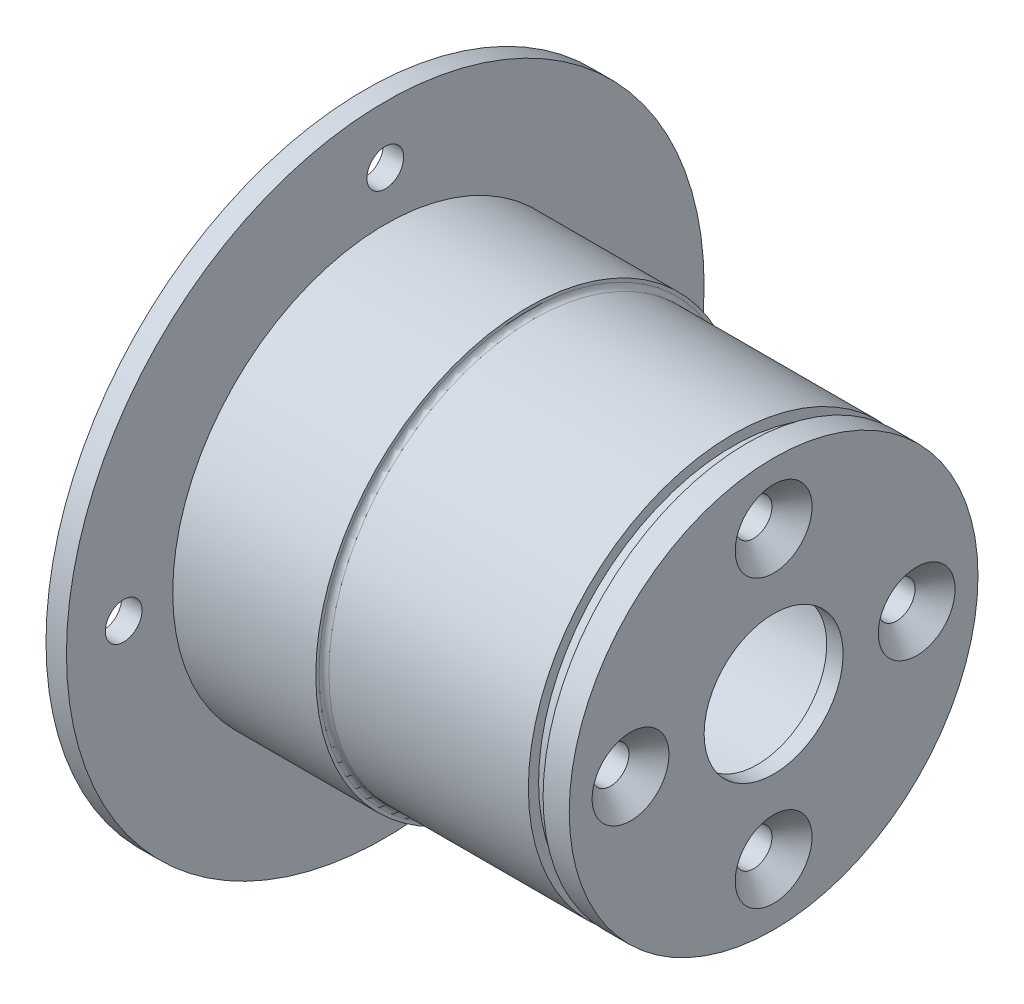
ISO-10303-21;
HEADER;
FILE_DESCRIPTION(('STEP AP214'),'2;1');
FILE_NAME('part.step','',(''),(''),'','','');
FILE_SCHEMA(('AUTOMOTIVE_DESIGN { 1 0 10303 214 1 1 1 1 }'));
ENDSEC;
DATA;
#1=APPLICATION_CONTEXT('core data for automotive mechanical design processes');
#2=APPLICATION_PROTOCOL_DEFINITION('international standard','automotive_design',2000,#1);
#3=PRODUCT_CONTEXT('',#1,'mechanical');
#4=PRODUCT('Part','Part','',(#3));
#5=PRODUCT_RELATED_PRODUCT_CATEGORY('part','',(#4));
#6=PRODUCT_DEFINITION_FORMATION('','',#4);
#7=PRODUCT_DEFINITION_CONTEXT('part definition',#1,'design');
#8=PRODUCT_DEFINITION('design','',#6,#7);
#9=PRODUCT_DEFINITION_SHAPE('','',#8);
#10=(LENGTH_UNIT() NAMED_UNIT(*) SI_UNIT(.MILLI.,.METRE.));
#11=(NAMED_UNIT(*) PLANE_ANGLE_UNIT() SI_UNIT($,.RADIAN.));
#12=(NAMED_UNIT(*) SI_UNIT($,.STERADIAN.) SOLID_ANGLE_UNIT());
#13=UNCERTAINTY_MEASURE_WITH_UNIT(LENGTH_MEASURE(1.E-05),#10,'distance_accuracy_value','');
#14=(GEOMETRIC_REPRESENTATION_CONTEXT(3) GLOBAL_UNCERTAINTY_ASSIGNED_CONTEXT((#13)) GLOBAL_UNIT_ASSIGNED_CONTEXT((#10,
#11,#12)) REPRESENTATION_CONTEXT('',''));
#15=CARTESIAN_POINT('',(0.,0.,0.));
#16=DIRECTION('',(0.,0.,1.));
#17=DIRECTION('',(1.,0.,0.));
#18=AXIS2_PLACEMENT_3D('',#15,#16,#17);
#19=CARTESIAN_POINT('',(0.,39.,0.));
#20=DIRECTION('',(1.,0.,0.));
#21=DIRECTION('',(0.,0.,-1.));
#22=AXIS2_PLACEMENT_3D('',#19,#20,#21);
#23=PLANE('',#22);
#24=CARTESIAN_POINT('',(0.,-32.,0.));
#25=DIRECTION('',(-1.,0.,0.));
#26=DIRECTION('',(0.,0.,1.));
#27=AXIS2_PLACEMENT_3D('',#24,#25,#26);
#28=CIRCLE('',#27,2.25);
#29=CARTESIAN_POINT('',(0.,-32.,2.25));
#30=VERTEX_POINT('',#29);
#31=EDGE_CURVE('E144',#30,#30,#28,.T.);
#32=ORIENTED_EDGE('',*,*,#31,.F.);
#33=EDGE_LOOP('',(#32));
#34=FACE_BOUND('',#33,.T.);
#35=CARTESIAN_POINT('',(0.,0.,32.));
#36=DIRECTION('',(-1.,0.,0.));
#37=DIRECTION('',(0.,0.,1.));
#38=AXIS2_PLACEMENT_3D('',#35,#36,#37);
#39=CIRCLE('',#38,2.25);
#40=CARTESIAN_POINT('',(0.,0.,34.25));
#41=VERTEX_POINT('',#40);
#42=EDGE_CURVE('E138',#41,#41,#39,.T.);
#43=ORIENTED_EDGE('',*,*,#42,.F.);
#44=EDGE_LOOP('',(#43));
#45=FACE_BOUND('',#44,.T.);
#46=CARTESIAN_POINT('',(0.,0.,-32.));
#47=DIRECTION('',(-1.,0.,0.));
#48=DIRECTION('',(0.,0.,1.));
#49=AXIS2_PLACEMENT_3D('',#46,#47,#48);
#50=CIRCLE('',#49,2.25);
#51=CARTESIAN_POINT('',(0.,0.,-29.75));
#52=VERTEX_POINT('',#51);
#53=EDGE_CURVE('E132',#52,#52,#50,.T.);
#54=ORIENTED_EDGE('',*,*,#53,.F.);
#55=EDGE_LOOP('',(#54));
#56=FACE_BOUND('',#55,.T.);
#57=CARTESIAN_POINT('',(0.,0.,0.));
#58=DIRECTION('',(-1.,0.,0.));
#59=DIRECTION('',(0.,0.,1.));
#60=AXIS2_PLACEMENT_3D('',#57,#58,#59);
#61=CIRCLE('',#60,21.);
#62=CARTESIAN_POINT('',(0.,0.,21.));
#63=VERTEX_POINT('',#62);
#64=EDGE_CURVE('E45',#63,#63,#61,.T.);
#65=ORIENTED_EDGE('',*,*,#64,.F.);
#66=EDGE_LOOP('',(#65));
#67=FACE_BOUND('',#66,.T.);
#68=CARTESIAN_POINT('',(0.,0.,0.));
#69=DIRECTION('',(-1.,0.,0.));
#70=DIRECTION('',(0.,0.,1.));
#71=AXIS2_PLACEMENT_3D('',#68,#69,#70);
#72=CIRCLE('',#71,39.);
#73=CARTESIAN_POINT('',(0.,0.,39.));
#74=VERTEX_POINT('',#73);
#75=EDGE_CURVE('E78',#74,#74,#72,.T.);
#76=ORIENTED_EDGE('',*,*,#75,.T.);
#77=EDGE_LOOP('',(#76));
#78=FACE_BOUND('',#77,.T.);
#79=CARTESIAN_POINT('',(0.,32.,0.));
#80=DIRECTION('',(-1.,0.,0.));
#81=DIRECTION('',(0.,0.,1.));
#82=AXIS2_PLACEMENT_3D('',#79,#80,#81);
#83=CIRCLE('',#82,2.25);
#84=CARTESIAN_POINT('',(0.,32.,2.25));
#85=VERTEX_POINT('',#84);
#86=EDGE_CURVE('E150',#85,#85,#83,.T.);
#87=ORIENTED_EDGE('',*,*,#86,.F.);
#88=EDGE_LOOP('',(#87));
#89=FACE_BOUND('',#88,.T.);
#90=ADVANCED_FACE('F34',(#34,#45,#56,#67,#78,#89),#23,.F.);
#91=CARTESIAN_POINT('',(-64.1033524540557,0.,0.));
#92=DIRECTION('',(-1.,0.,0.));
#93=DIRECTION('',(0.,0.,1.));
#94=AXIS2_PLACEMENT_3D('',#91,#92,#93);
#95=CYLINDRICAL_SURFACE('',#94,25.);
#96=CARTESIAN_POINT('',(20.6,0.,0.));
#97=DIRECTION('',(-1.,0.,0.));
#98=DIRECTION('',(0.,0.,1.));
#99=AXIS2_PLACEMENT_3D('',#96,#97,#98);
#100=CIRCLE('',#99,25.);
#101=CARTESIAN_POINT('',(20.6,0.,25.));
#102=VERTEX_POINT('',#101);
#103=EDGE_CURVE('E10',#102,#102,#100,.F.);
#104=ORIENTED_EDGE('',*,*,#103,.T.);
#105=EDGE_LOOP('',(#104));
#106=FACE_BOUND('',#105,.T.);
#107=CARTESIAN_POINT('',(45.,0.,0.));
#108=DIRECTION('',(1.,0.,0.));
#109=DIRECTION('',(0.,0.,-1.));
#110=AXIS2_PLACEMENT_3D('',#107,#108,#109);
#111=CIRCLE('',#110,25.);
#112=CARTESIAN_POINT('',(45.,0.,-25.));
#113=VERTEX_POINT('',#112);
#114=EDGE_CURVE('E118',#113,#113,#111,.T.);
#115=ORIENTED_EDGE('',*,*,#114,.F.);
#116=EDGE_LOOP('',(#115));
#117=FACE_BOUND('',#116,.T.);
#118=ADVANCED_FACE('F157',(#106,#117),#95,.T.);
#119=CARTESIAN_POINT('',(50.,8.5,0.));
#120=DIRECTION('',(-1.,0.,0.));
#121=DIRECTION('',(0.,0.,1.));
#122=AXIS2_PLACEMENT_3D('',#119,#120,#121);
#123=PLANE('',#122);
#124=CARTESIAN_POINT('',(50.,17.5,0.));
#125=DIRECTION('',(1.,0.,0.));
#126=DIRECTION('',(0.,0.,-1.));
#127=AXIS2_PLACEMENT_3D('',#124,#125,#126);
#128=CIRCLE('',#127,4.7);
#129=CARTESIAN_POINT('',(50.,17.5,-4.7));
#130=VERTEX_POINT('',#129);
#131=EDGE_CURVE('E114',#130,#130,#128,.T.);
#132=ORIENTED_EDGE('',*,*,#131,.F.);
#133=EDGE_LOOP('',(#132));
#134=FACE_BOUND('',#133,.T.);
#135=CARTESIAN_POINT('',(50.,-17.5,0.));
#136=DIRECTION('',(1.,0.,0.));
#137=DIRECTION('',(0.,0.,-1.));
#138=AXIS2_PLACEMENT_3D('',#135,#136,#137);
#139=CIRCLE('',#138,4.7);
#140=CARTESIAN_POINT('',(50.,-17.5,-4.7));
#141=VERTEX_POINT('',#140);
#142=EDGE_CURVE('E96',#141,#141,#139,.T.);
#143=ORIENTED_EDGE('',*,*,#142,.F.);
#144=EDGE_LOOP('',(#143));
#145=FACE_BOUND('',#144,.T.);
#146=CARTESIAN_POINT('',(50.,0.,17.5));
#147=DIRECTION('',(1.,0.,0.));
#148=DIRECTION('',(0.,0.,-1.));
#149=AXIS2_PLACEMENT_3D('',#146,#147,#148);
#150=CIRCLE('',#149,4.7);
#151=CARTESIAN_POINT('',(50.,0.,12.8));
#152=VERTEX_POINT('',#151);
#153=EDGE_CURVE('E87',#152,#152,#150,.T.);
#154=ORIENTED_EDGE('',*,*,#153,.F.);
#155=EDGE_LOOP('',(#154));
#156=FACE_BOUND('',#155,.T.);
#157=CARTESIAN_POINT('',(50.,0.,0.));
#158=DIRECTION('',(-1.,0.,0.));
#159=DIRECTION('',(0.,0.,1.));
#160=AXIS2_PLACEMENT_3D('',#157,#158,#159);
#161=CIRCLE('',#160,25.);
#162=CARTESIAN_POINT('',(50.,0.,25.));
#163=VERTEX_POINT('',#162);
#164=EDGE_CURVE('E66',#163,#163,#161,.T.);
#165=ORIENTED_EDGE('',*,*,#164,.F.);
#166=EDGE_LOOP('',(#165));
#167=FACE_BOUND('',#166,.T.);
#168=CARTESIAN_POINT('',(50.,0.,0.));
#169=DIRECTION('',(-1.,0.,0.));
#170=DIRECTION('',(0.,0.,1.));
#171=AXIS2_PLACEMENT_3D('',#168,#169,#170);
#172=CIRCLE('',#171,8.5);
#173=CARTESIAN_POINT('',(50.,0.,8.5));
#174=VERTEX_POINT('',#173);
#175=EDGE_CURVE('E63',#174,#174,#172,.T.);
#176=ORIENTED_EDGE('',*,*,#175,.T.);
#177=EDGE_LOOP('',(#176));
#178=FACE_BOUND('',#177,.T.);
#179=CARTESIAN_POINT('',(50.,0.,-17.5));
#180=DIRECTION('',(1.,0.,0.));
#181=DIRECTION('',(0.,0.,-1.));
#182=AXIS2_PLACEMENT_3D('',#179,#180,#181);
#183=CIRCLE('',#182,4.7);
#184=CARTESIAN_POINT('',(50.,0.,-22.2));
#185=VERTEX_POINT('',#184);
#186=EDGE_CURVE('E105',#185,#185,#183,.T.);
#187=ORIENTED_EDGE('',*,*,#186,.F.);
#188=EDGE_LOOP('',(#187));
#189=FACE_BOUND('',#188,.T.);
#190=ADVANCED_FACE('F163',(#134,#145,#156,#167,#178,#189),#123,.F.);
#191=CARTESIAN_POINT('',(-64.1033524540557,0.,0.));
#192=DIRECTION('',(-1.,0.,0.));
#193=DIRECTION('',(0.,0.,1.));
#194=AXIS2_PLACEMENT_3D('',#191,#192,#193);
#195=CYLINDRICAL_SURFACE('',#194,21.);
#196=CARTESIAN_POINT('',(35.,0.,0.));
#197=DIRECTION('',(-1.,0.,0.));
#198=DIRECTION('',(0.,0.,1.));
#199=AXIS2_PLACEMENT_3D('',#196,#197,#198);
#200=CIRCLE('',#199,21.);
#201=CARTESIAN_POINT('',(35.,0.,21.));
#202=VERTEX_POINT('',#201);
#203=EDGE_CURVE('E49',#202,#202,#200,.T.);
#204=ORIENTED_EDGE('',*,*,#203,.F.);
#205=EDGE_LOOP('',(#204));
#206=FACE_BOUND('',#205,.T.);
#207=ORIENTED_EDGE('',*,*,#64,.T.);
#208=EDGE_LOOP('',(#207));
#209=FACE_BOUND('',#208,.T.);
#210=ADVANCED_FACE('F192',(#206,#209),#195,.F.);
#211=CARTESIAN_POINT('',(35.,21.,0.));
#212=DIRECTION('',(1.,0.,0.));
#213=DIRECTION('',(0.,0.,-1.));
#214=AXIS2_PLACEMENT_3D('',#211,#212,#213);
#215=PLANE('',#214);
#216=CARTESIAN_POINT('',(35.,17.5,0.));
#217=DIRECTION('',(1.,0.,0.));
#218=DIRECTION('',(0.,0.,-1.));
#219=AXIS2_PLACEMENT_3D('',#216,#217,#218);
#220=CIRCLE('',#219,2.24999999999999);
#221=CARTESIAN_POINT('',(35.,17.5,-2.24999999999999));
#222=VERTEX_POINT('',#221);
#223=EDGE_CURVE('E108',#222,#222,#220,.T.);
#224=ORIENTED_EDGE('',*,*,#223,.T.);
#225=EDGE_LOOP('',(#224));
#226=FACE_BOUND('',#225,.T.);
#227=CARTESIAN_POINT('',(35.,0.,-17.5));
#228=DIRECTION('',(1.,0.,0.));
#229=DIRECTION('',(0.,0.,-1.));
#230=AXIS2_PLACEMENT_3D('',#227,#228,#229);
#231=CIRCLE('',#230,2.24999999999999);
#232=CARTESIAN_POINT('',(35.,0.,-19.75));
#233=VERTEX_POINT('',#232);
#234=EDGE_CURVE('E99',#233,#233,#231,.T.);
#235=ORIENTED_EDGE('',*,*,#234,.T.);
#236=EDGE_LOOP('',(#235));
#237=FACE_BOUND('',#236,.T.);
#238=CARTESIAN_POINT('',(35.,-17.5,0.));
#239=DIRECTION('',(1.,0.,0.));
#240=DIRECTION('',(0.,0.,-1.));
#241=AXIS2_PLACEMENT_3D('',#238,#239,#240);
#242=CIRCLE('',#241,2.24999999999999);
#243=CARTESIAN_POINT('',(35.,-17.5,-2.24999999999999));
#244=VERTEX_POINT('',#243);
#245=EDGE_CURVE('E90',#244,#244,#242,.T.);
#246=ORIENTED_EDGE('',*,*,#245,.T.);
#247=EDGE_LOOP('',(#246));
#248=FACE_BOUND('',#247,.T.);
#249=CARTESIAN_POINT('',(35.,0.,17.5));
#250=DIRECTION('',(1.,0.,0.));
#251=DIRECTION('',(0.,0.,-1.));
#252=AXIS2_PLACEMENT_3D('',#249,#250,#251);
#253=CIRCLE('',#252,2.24999999999999);
#254=CARTESIAN_POINT('',(35.,0.,15.25));
#255=VERTEX_POINT('',#254);
#256=EDGE_CURVE('E81',#255,#255,#253,.T.);
#257=ORIENTED_EDGE('',*,*,#256,.T.);
#258=EDGE_LOOP('',(#257));
#259=FACE_BOUND('',#258,.T.);
#260=CARTESIAN_POINT('',(35.,0.,0.));
#261=DIRECTION('',(-1.,0.,0.));
#262=DIRECTION('',(0.,0.,1.));
#263=AXIS2_PLACEMENT_3D('',#260,#261,#262);
#264=CIRCLE('',#263,12.5);
#265=CARTESIAN_POINT('',(35.,0.,12.5));
#266=VERTEX_POINT('',#265);
#267=EDGE_CURVE('E54',#266,#266,#264,.T.);
#268=ORIENTED_EDGE('',*,*,#267,.F.);
#269=EDGE_LOOP('',(#268));
#270=FACE_BOUND('',#269,.T.);
#271=ORIENTED_EDGE('',*,*,#203,.T.);
#272=EDGE_LOOP('',(#271));
#273=FACE_BOUND('',#272,.T.);
#274=ADVANCED_FACE('F204',(#226,#237,#248,#259,#270,#273),#215,.F.);
#275=CARTESIAN_POINT('',(-64.1033524540557,0.,0.));
#276=DIRECTION('',(-1.,0.,0.));
#277=DIRECTION('',(0.,0.,1.));
#278=AXIS2_PLACEMENT_3D('',#275,#276,#277);
#279=CYLINDRICAL_SURFACE('',#278,12.5);
#280=CARTESIAN_POINT('',(48.,0.,0.));
#281=DIRECTION('',(-1.,0.,0.));
#282=DIRECTION('',(0.,0.,1.));
#283=AXIS2_PLACEMENT_3D('',#280,#281,#282);
#284=CIRCLE('',#283,12.5);
#285=CARTESIAN_POINT('',(48.,0.,12.5));
#286=VERTEX_POINT('',#285);
#287=EDGE_CURVE('E57',#286,#286,#284,.T.);
#288=ORIENTED_EDGE('',*,*,#287,.F.);
#289=EDGE_LOOP('',(#288));
#290=FACE_BOUND('',#289,.T.);
#291=ORIENTED_EDGE('',*,*,#267,.T.);
#292=EDGE_LOOP('',(#291));
#293=FACE_BOUND('',#292,.T.);
#294=ADVANCED_FACE('F200',(#290,#293),#279,.F.);
#295=CARTESIAN_POINT('',(48.,12.5,0.));
#296=DIRECTION('',(1.,0.,0.));
#297=DIRECTION('',(0.,0.,-1.));
#298=AXIS2_PLACEMENT_3D('',#295,#296,#297);
#299=PLANE('',#298);
#300=CARTESIAN_POINT('',(48.,0.,0.));
#301=DIRECTION('',(-1.,0.,0.));
#302=DIRECTION('',(0.,0.,1.));
#303=AXIS2_PLACEMENT_3D('',#300,#301,#302);
#304=CIRCLE('',#303,8.5);
#305=CARTESIAN_POINT('',(48.,0.,8.5));
#306=VERTEX_POINT('',#305);
#307=EDGE_CURVE('E60',#306,#306,#304,.T.);
#308=ORIENTED_EDGE('',*,*,#307,.F.);
#309=EDGE_LOOP('',(#308));
#310=FACE_BOUND('',#309,.T.);
#311=ORIENTED_EDGE('',*,*,#287,.T.);
#312=EDGE_LOOP('',(#311));
#313=FACE_BOUND('',#312,.T.);
#314=ADVANCED_FACE('F196',(#310,#313),#299,.F.);
#315=CARTESIAN_POINT('',(-64.1033524540557,0.,0.));
#316=DIRECTION('',(-1.,0.,0.));
#317=DIRECTION('',(0.,0.,1.));
#318=AXIS2_PLACEMENT_3D('',#315,#316,#317);
#319=CYLINDRICAL_SURFACE('',#318,8.5);
#320=ORIENTED_EDGE('',*,*,#175,.F.);
#321=EDGE_LOOP('',(#320));
#322=FACE_BOUND('',#321,.T.);
#323=ORIENTED_EDGE('',*,*,#307,.T.);
#324=EDGE_LOOP('',(#323));
#325=FACE_BOUND('',#324,.T.);
#326=ADVANCED_FACE('F188',(#322,#325),#319,.F.);
#327=CARTESIAN_POINT('',(46.8,0.,0.));
#328=DIRECTION('',(1.,0.,0.));
#329=DIRECTION('',(0.,0.,-1.));
#330=AXIS2_PLACEMENT_3D('',#327,#328,#329);
#331=CIRCLE('',#330,25.);
#332=CARTESIAN_POINT('',(46.8,0.,-25.));
#333=VERTEX_POINT('',#332);
#334=EDGE_CURVE('E117',#333,#333,#331,.T.);
#335=ORIENTED_EDGE('',*,*,#334,.T.);
#336=EDGE_LOOP('',(#335));
#337=FACE_BOUND('',#336,.T.);
#338=ORIENTED_EDGE('',*,*,#164,.T.);
#339=EDGE_LOOP('',(#338));
#340=FACE_BOUND('',#339,.T.);
#341=ADVANCED_FACE('F165',(#337,#340),#95,.T.);
#342=CARTESIAN_POINT('',(20.,25.,0.));
#343=DIRECTION('',(-1.,0.,0.));
#344=DIRECTION('',(0.,0.,1.));
#345=AXIS2_PLACEMENT_3D('',#342,#343,#344);
#346=PLANE('',#345);
#347=CARTESIAN_POINT('',(20.,0.,0.));
#348=DIRECTION('',(-1.,0.,0.));
#349=DIRECTION('',(0.,0.,1.));
#350=AXIS2_PLACEMENT_3D('',#347,#348,#349);
#351=CIRCLE('',#350,25.6);
#352=CARTESIAN_POINT('',(20.,0.,25.6));
#353=VERTEX_POINT('',#352);
#354=EDGE_CURVE('E41',#353,#353,#351,.T.);
#355=ORIENTED_EDGE('',*,*,#354,.T.);
#356=EDGE_LOOP('',(#355));
#357=FACE_BOUND('',#356,.T.);
#358=CARTESIAN_POINT('',(20.,0.,0.));
#359=DIRECTION('',(-1.,0.,0.));
#360=DIRECTION('',(0.,0.,1.));
#361=AXIS2_PLACEMENT_3D('',#358,#359,#360);
#362=CIRCLE('',#361,26.);
#363=CARTESIAN_POINT('',(20.,0.,26.));
#364=VERTEX_POINT('',#363);
#365=EDGE_CURVE('E69',#364,#364,#362,.T.);
#366=ORIENTED_EDGE('',*,*,#365,.F.);
#367=EDGE_LOOP('',(#366));
#368=FACE_BOUND('',#367,.T.);
#369=ADVANCED_FACE('F183',(#357,#368),#346,.F.);
#370=CARTESIAN_POINT('',(-64.1033524540557,0.,0.));
#371=DIRECTION('',(-1.,0.,0.));
#372=DIRECTION('',(0.,0.,1.));
#373=AXIS2_PLACEMENT_3D('',#370,#371,#372);
#374=CYLINDRICAL_SURFACE('',#373,26.);
#375=CARTESIAN_POINT('',(2.5,0.,0.));
#376=DIRECTION('',(-1.,0.,0.));
#377=DIRECTION('',(0.,0.,1.));
#378=AXIS2_PLACEMENT_3D('',#375,#376,#377);
#379=CIRCLE('',#378,26.);
#380=CARTESIAN_POINT('',(2.5,0.,26.));
#381=VERTEX_POINT('',#380);
#382=EDGE_CURVE('E72',#381,#381,#379,.T.);
#383=ORIENTED_EDGE('',*,*,#382,.F.);
#384=EDGE_LOOP('',(#383));
#385=FACE_BOUND('',#384,.T.);
#386=ORIENTED_EDGE('',*,*,#365,.T.);
#387=EDGE_LOOP('',(#386));
#388=FACE_BOUND('',#387,.T.);
#389=ADVANCED_FACE('F179',(#385,#388),#374,.T.);
#390=CARTESIAN_POINT('',(2.5,26.,0.));
#391=DIRECTION('',(-1.,0.,0.));
#392=DIRECTION('',(0.,0.,1.));
#393=AXIS2_PLACEMENT_3D('',#390,#391,#392);
#394=PLANE('',#393);
#395=CARTESIAN_POINT('',(2.5,32.,0.));
#396=DIRECTION('',(-1.,0.,0.));
#397=DIRECTION('',(0.,0.,1.));
#398=AXIS2_PLACEMENT_3D('',#395,#396,#397);
#399=CIRCLE('',#398,2.25);
#400=CARTESIAN_POINT('',(2.5,32.,2.25));
#401=VERTEX_POINT('',#400);
#402=EDGE_CURVE('E147',#401,#401,#399,.T.);
#403=ORIENTED_EDGE('',*,*,#402,.T.);
#404=EDGE_LOOP('',(#403));
#405=FACE_BOUND('',#404,.T.);
#406=CARTESIAN_POINT('',(2.5,-32.,0.));
#407=DIRECTION('',(-1.,0.,0.));
#408=DIRECTION('',(0.,0.,1.));
#409=AXIS2_PLACEMENT_3D('',#406,#407,#408);
#410=CIRCLE('',#409,2.25);
#411=CARTESIAN_POINT('',(2.5,-32.,2.25));
#412=VERTEX_POINT('',#411);
#413=EDGE_CURVE('E141',#412,#412,#410,.T.);
#414=ORIENTED_EDGE('',*,*,#413,.T.);
#415=EDGE_LOOP('',(#414));
#416=FACE_BOUND('',#415,.T.);
#417=CARTESIAN_POINT('',(2.5,0.,32.));
#418=DIRECTION('',(-1.,0.,0.));
#419=DIRECTION('',(0.,0.,1.));
#420=AXIS2_PLACEMENT_3D('',#417,#418,#419);
#421=CIRCLE('',#420,2.25);
#422=CARTESIAN_POINT('',(2.5,0.,34.25));
#423=VERTEX_POINT('',#422);
#424=EDGE_CURVE('E135',#423,#423,#421,.T.);
#425=ORIENTED_EDGE('',*,*,#424,.T.);
#426=EDGE_LOOP('',(#425));
#427=FACE_BOUND('',#426,.T.);
#428=CARTESIAN_POINT('',(2.5,0.,-32.));
#429=DIRECTION('',(-1.,0.,0.));
#430=DIRECTION('',(0.,0.,1.));
#431=AXIS2_PLACEMENT_3D('',#428,#429,#430);
#432=CIRCLE('',#431,2.25);
#433=CARTESIAN_POINT('',(2.5,0.,-29.75));
#434=VERTEX_POINT('',#433);
#435=EDGE_CURVE('E127',#434,#434,#432,.T.);
#436=ORIENTED_EDGE('',*,*,#435,.T.);
#437=EDGE_LOOP('',(#436));
#438=FACE_BOUND('',#437,.T.);
#439=CARTESIAN_POINT('',(2.5,0.,0.));
#440=DIRECTION('',(-1.,0.,0.));
#441=DIRECTION('',(0.,0.,1.));
#442=AXIS2_PLACEMENT_3D('',#439,#440,#441);
#443=CIRCLE('',#442,39.);
#444=CARTESIAN_POINT('',(2.5,0.,39.));
#445=VERTEX_POINT('',#444);
#446=EDGE_CURVE('E75',#445,#445,#443,.T.);
#447=ORIENTED_EDGE('',*,*,#446,.F.);
#448=EDGE_LOOP('',(#447));
#449=FACE_BOUND('',#448,.T.);
#450=ORIENTED_EDGE('',*,*,#382,.T.);
#451=EDGE_LOOP('',(#450));
#452=FACE_BOUND('',#451,.T.);
#453=ADVANCED_FACE('F175',(#405,#416,#427,#438,#449,#452),#394,.F.);
#454=CARTESIAN_POINT('',(-64.1033524540557,0.,0.));
#455=DIRECTION('',(-1.,0.,0.));
#456=DIRECTION('',(0.,0.,1.));
#457=AXIS2_PLACEMENT_3D('',#454,#455,#456);
#458=CYLINDRICAL_SURFACE('',#457,39.);
#459=ORIENTED_EDGE('',*,*,#75,.F.);
#460=EDGE_LOOP('',(#459));
#461=FACE_BOUND('',#460,.T.);
#462=ORIENTED_EDGE('',*,*,#446,.T.);
#463=EDGE_LOOP('',(#462));
#464=FACE_BOUND('',#463,.T.);
#465=ADVANCED_FACE('F172',(#461,#464),#458,.T.);
#466=CARTESIAN_POINT('',(50.,0.,17.5));
#467=DIRECTION('',(1.,0.,0.));
#468=DIRECTION('',(0.,0.,-1.));
#469=AXIS2_PLACEMENT_3D('',#466,#467,#468);
#470=CYLINDRICAL_SURFACE('',#469,2.24999999999999);
#471=ORIENTED_EDGE('',*,*,#256,.F.);
#472=EDGE_LOOP('',(#471));
#473=FACE_BOUND('',#472,.T.);
#474=CARTESIAN_POINT('',(47.55,0.,17.5));
#475=DIRECTION('',(1.,0.,0.));
#476=DIRECTION('',(0.,0.,-1.));
#477=AXIS2_PLACEMENT_3D('',#474,#475,#476);
#478=CIRCLE('',#477,2.24999999999999);
#479=CARTESIAN_POINT('',(47.55,0.,15.25));
#480=VERTEX_POINT('',#479);
#481=EDGE_CURVE('E84',#480,#480,#478,.T.);
#482=ORIENTED_EDGE('',*,*,#481,.T.);
#483=EDGE_LOOP('',(#482));
#484=FACE_BOUND('',#483,.T.);
#485=ADVANCED_FACE('F170',(#473,#484),#470,.F.);
#486=CARTESIAN_POINT('',(50.,0.,17.5));
#487=DIRECTION('',(1.,0.,0.));
#488=DIRECTION('',(0.,0.,-1.));
#489=AXIS2_PLACEMENT_3D('',#486,#487,#488);
#490=CONICAL_SURFACE('',#489,4.7,0.785398163397449);
#491=ORIENTED_EDGE('',*,*,#481,.F.);
#492=EDGE_LOOP('',(#491));
#493=FACE_BOUND('',#492,.T.);
#494=ORIENTED_EDGE('',*,*,#153,.T.);
#495=EDGE_LOOP('',(#494));
#496=FACE_BOUND('',#495,.T.);
#497=ADVANCED_FACE('F276',(#493,#496),#490,.F.);
#498=CARTESIAN_POINT('',(50.,-17.5,0.));
#499=DIRECTION('',(1.,0.,0.));
#500=DIRECTION('',(0.,0.,-1.));
#501=AXIS2_PLACEMENT_3D('',#498,#499,#500);
#502=CYLINDRICAL_SURFACE('',#501,2.24999999999999);
#503=ORIENTED_EDGE('',*,*,#245,.F.);
#504=EDGE_LOOP('',(#503));
#505=FACE_BOUND('',#504,.T.);
#506=CARTESIAN_POINT('',(47.55,-17.5,0.));
#507=DIRECTION('',(1.,0.,0.));
#508=DIRECTION('',(0.,0.,-1.));
#509=AXIS2_PLACEMENT_3D('',#506,#507,#508);
#510=CIRCLE('',#509,2.24999999999999);
#511=CARTESIAN_POINT('',(47.55,-17.5,-2.24999999999999));
#512=VERTEX_POINT('',#511);
#513=EDGE_CURVE('E93',#512,#512,#510,.T.);
#514=ORIENTED_EDGE('',*,*,#513,.T.);
#515=EDGE_LOOP('',(#514));
#516=FACE_BOUND('',#515,.T.);
#517=ADVANCED_FACE('F283',(#505,#516),#502,.F.);
#518=CARTESIAN_POINT('',(50.,-17.5,0.));
#519=DIRECTION('',(1.,0.,0.));
#520=DIRECTION('',(0.,0.,-1.));
#521=AXIS2_PLACEMENT_3D('',#518,#519,#520);
#522=CONICAL_SURFACE('',#521,4.7,0.785398163397449);
#523=ORIENTED_EDGE('',*,*,#513,.F.);
#524=EDGE_LOOP('',(#523));
#525=FACE_BOUND('',#524,.T.);
#526=ORIENTED_EDGE('',*,*,#142,.T.);
#527=EDGE_LOOP('',(#526));
#528=FACE_BOUND('',#527,.T.);
#529=ADVANCED_FACE('F290',(#525,#528),#522,.F.);
#530=CARTESIAN_POINT('',(50.,0.,-17.5));
#531=DIRECTION('',(1.,0.,0.));
#532=DIRECTION('',(0.,0.,-1.));
#533=AXIS2_PLACEMENT_3D('',#530,#531,#532);
#534=CYLINDRICAL_SURFACE('',#533,2.24999999999999);
#535=ORIENTED_EDGE('',*,*,#234,.F.);
#536=EDGE_LOOP('',(#535));
#537=FACE_BOUND('',#536,.T.);
#538=CARTESIAN_POINT('',(47.55,0.,-17.5));
#539=DIRECTION('',(1.,0.,0.));
#540=DIRECTION('',(0.,0.,-1.));
#541=AXIS2_PLACEMENT_3D('',#538,#539,#540);
#542=CIRCLE('',#541,2.24999999999999);
#543=CARTESIAN_POINT('',(47.55,0.,-19.75));
#544=VERTEX_POINT('',#543);
#545=EDGE_CURVE('E102',#544,#544,#542,.T.);
#546=ORIENTED_EDGE('',*,*,#545,.T.);
#547=EDGE_LOOP('',(#546));
#548=FACE_BOUND('',#547,.T.);
#549=ADVANCED_FACE('F298',(#537,#548),#534,.F.);
#550=CARTESIAN_POINT('',(50.,0.,-17.5));
#551=DIRECTION('',(1.,0.,0.));
#552=DIRECTION('',(0.,0.,-1.));
#553=AXIS2_PLACEMENT_3D('',#550,#551,#552);
#554=CONICAL_SURFACE('',#553,4.7,0.785398163397449);
#555=ORIENTED_EDGE('',*,*,#545,.F.);
#556=EDGE_LOOP('',(#555));
#557=FACE_BOUND('',#556,.T.);
#558=ORIENTED_EDGE('',*,*,#186,.T.);
#559=EDGE_LOOP('',(#558));
#560=FACE_BOUND('',#559,.T.);
#561=ADVANCED_FACE('F306',(#557,#560),#554,.F.);
#562=CARTESIAN_POINT('',(50.,17.5,0.));
#563=DIRECTION('',(1.,0.,0.));
#564=DIRECTION('',(0.,0.,-1.));
#565=AXIS2_PLACEMENT_3D('',#562,#563,#564);
#566=CYLINDRICAL_SURFACE('',#565,2.24999999999999);
#567=ORIENTED_EDGE('',*,*,#223,.F.);
#568=EDGE_LOOP('',(#567));
#569=FACE_BOUND('',#568,.T.);
#570=CARTESIAN_POINT('',(47.55,17.5,0.));
#571=DIRECTION('',(1.,0.,0.));
#572=DIRECTION('',(0.,0.,-1.));
#573=AXIS2_PLACEMENT_3D('',#570,#571,#572);
#574=CIRCLE('',#573,2.24999999999999);
#575=CARTESIAN_POINT('',(47.55,17.5,-2.24999999999999));
#576=VERTEX_POINT('',#575);
#577=EDGE_CURVE('E111',#576,#576,#574,.T.);
#578=ORIENTED_EDGE('',*,*,#577,.T.);
#579=EDGE_LOOP('',(#578));
#580=FACE_BOUND('',#579,.T.);
#581=ADVANCED_FACE('F314',(#569,#580),#566,.F.);
#582=CARTESIAN_POINT('',(50.,17.5,0.));
#583=DIRECTION('',(1.,0.,0.));
#584=DIRECTION('',(0.,0.,-1.));
#585=AXIS2_PLACEMENT_3D('',#582,#583,#584);
#586=CONICAL_SURFACE('',#585,4.7,0.785398163397449);
#587=ORIENTED_EDGE('',*,*,#577,.F.);
#588=EDGE_LOOP('',(#587));
#589=FACE_BOUND('',#588,.T.);
#590=ORIENTED_EDGE('',*,*,#131,.T.);
#591=EDGE_LOOP('',(#590));
#592=FACE_BOUND('',#591,.T.);
#593=ADVANCED_FACE('F322',(#589,#592),#586,.F.);
#594=CARTESIAN_POINT('',(20.6,0.,0.));
#595=DIRECTION('',(-1.,0.,0.));
#596=DIRECTION('',(0.,0.,1.));
#597=AXIS2_PLACEMENT_3D('',#594,#595,#596);
#598=TOROIDAL_SURFACE('',#597,25.6,0.6);
#599=ORIENTED_EDGE('',*,*,#103,.F.);
#600=EDGE_LOOP('',(#599));
#601=FACE_BOUND('',#600,.T.);
#602=ORIENTED_EDGE('',*,*,#354,.F.);
#603=EDGE_LOOP('',(#602));
#604=FACE_BOUND('',#603,.T.);
#605=ADVANCED_FACE('F36',(#601,#604),#598,.F.);
#606=CARTESIAN_POINT('',(46.8,0.,0.));
#607=DIRECTION('',(1.,0.,0.));
#608=DIRECTION('',(0.,0.,-1.));
#609=AXIS2_PLACEMENT_3D('',#606,#607,#608);
#610=PLANE('',#609);
#611=ORIENTED_EDGE('',*,*,#334,.F.);
#612=EDGE_LOOP('',(#611));
#613=FACE_BOUND('',#612,.T.);
#614=CARTESIAN_POINT('',(46.8,0.,0.));
#615=DIRECTION('',(1.,0.,0.));
#616=DIRECTION('',(0.,0.,-1.));
#617=AXIS2_PLACEMENT_3D('',#614,#615,#616);
#618=CIRCLE('',#617,23.75);
#619=CARTESIAN_POINT('',(46.8,0.,-23.75));
#620=VERTEX_POINT('',#619);
#621=EDGE_CURVE('E121',#620,#620,#618,.T.);
#622=ORIENTED_EDGE('',*,*,#621,.T.);
#623=EDGE_LOOP('',(#622));
#624=FACE_BOUND('',#623,.T.);
#625=ADVANCED_FACE('F335',(#613,#624),#610,.F.);
#626=CARTESIAN_POINT('',(45.,0.,0.));
#627=DIRECTION('',(1.,0.,0.));
#628=DIRECTION('',(0.,0.,-1.));
#629=AXIS2_PLACEMENT_3D('',#626,#627,#628);
#630=PLANE('',#629);
#631=ORIENTED_EDGE('',*,*,#114,.T.);
#632=EDGE_LOOP('',(#631));
#633=FACE_BOUND('',#632,.T.);
#634=CARTESIAN_POINT('',(45.,0.,0.));
#635=DIRECTION('',(1.,0.,0.));
#636=DIRECTION('',(0.,0.,-1.));
#637=AXIS2_PLACEMENT_3D('',#634,#635,#636);
#638=CIRCLE('',#637,23.75);
#639=CARTESIAN_POINT('',(45.,0.,-23.75));
#640=VERTEX_POINT('',#639);
#641=EDGE_CURVE('E124',#640,#640,#638,.T.);
#642=ORIENTED_EDGE('',*,*,#641,.F.);
#643=EDGE_LOOP('',(#642));
#644=FACE_BOUND('',#643,.T.);
#645=ADVANCED_FACE('F341',(#633,#644),#630,.T.);
#646=CARTESIAN_POINT('',(46.8,0.,0.));
#647=DIRECTION('',(-1.,0.,0.));
#648=DIRECTION('',(0.,0.,1.));
#649=AXIS2_PLACEMENT_3D('',#646,#647,#648);
#650=CYLINDRICAL_SURFACE('',#649,23.75);
#651=ORIENTED_EDGE('',*,*,#621,.F.);
#652=EDGE_LOOP('',(#651));
#653=FACE_BOUND('',#652,.T.);
#654=ORIENTED_EDGE('',*,*,#641,.T.);
#655=EDGE_LOOP('',(#654));
#656=FACE_BOUND('',#655,.T.);
#657=ADVANCED_FACE('F349',(#653,#656),#650,.T.);
#658=CARTESIAN_POINT('',(0.,0.,-32.));
#659=DIRECTION('',(-1.,0.,0.));
#660=DIRECTION('',(0.,0.,1.));
#661=AXIS2_PLACEMENT_3D('',#658,#659,#660);
#662=CYLINDRICAL_SURFACE('',#661,2.25);
#663=ORIENTED_EDGE('',*,*,#435,.F.);
#664=EDGE_LOOP('',(#663));
#665=FACE_BOUND('',#664,.T.);
#666=ORIENTED_EDGE('',*,*,#53,.T.);
#667=EDGE_LOOP('',(#666));
#668=FACE_BOUND('',#667,.T.);
#669=ADVANCED_FACE('F357',(#665,#668),#662,.F.);
#670=CARTESIAN_POINT('',(0.,0.,32.));
#671=DIRECTION('',(-1.,0.,0.));
#672=DIRECTION('',(0.,0.,1.));
#673=AXIS2_PLACEMENT_3D('',#670,#671,#672);
#674=CYLINDRICAL_SURFACE('',#673,2.25);
#675=ORIENTED_EDGE('',*,*,#424,.F.);
#676=EDGE_LOOP('',(#675));
#677=FACE_BOUND('',#676,.T.);
#678=ORIENTED_EDGE('',*,*,#42,.T.);
#679=EDGE_LOOP('',(#678));
#680=FACE_BOUND('',#679,.T.);
#681=ADVANCED_FACE('F364',(#677,#680),#674,.F.);
#682=CARTESIAN_POINT('',(0.,-32.,0.));
#683=DIRECTION('',(-1.,0.,0.));
#684=DIRECTION('',(0.,0.,1.));
#685=AXIS2_PLACEMENT_3D('',#682,#683,#684);
#686=CYLINDRICAL_SURFACE('',#685,2.25);
#687=ORIENTED_EDGE('',*,*,#413,.F.);
#688=EDGE_LOOP('',(#687));
#689=FACE_BOUND('',#688,.T.);
#690=ORIENTED_EDGE('',*,*,#31,.T.);
#691=EDGE_LOOP('',(#690));
#692=FACE_BOUND('',#691,.T.);
#693=ADVANCED_FACE('F372',(#689,#692),#686,.F.);
#694=CARTESIAN_POINT('',(0.,32.,0.));
#695=DIRECTION('',(-1.,0.,0.));
#696=DIRECTION('',(0.,0.,1.));
#697=AXIS2_PLACEMENT_3D('',#694,#695,#696);
#698=CYLINDRICAL_SURFACE('',#697,2.25);
#699=ORIENTED_EDGE('',*,*,#402,.F.);
#700=EDGE_LOOP('',(#699));
#701=FACE_BOUND('',#700,.T.);
#702=ORIENTED_EDGE('',*,*,#86,.T.);
#703=EDGE_LOOP('',(#702));
#704=FACE_BOUND('',#703,.T.);
#705=ADVANCED_FACE('F154',(#701,#704),#698,.F.);
#706=CLOSED_SHELL('',(#90,#118,#190,#210,#274,#294,#314,#326,#341,#369,#389,#453,#465,#485,#497,
#517,#529,#549,#561,#581,#593,#605,#625,#645,#657,#669,#681,#693,#705));
#707=MANIFOLD_SOLID_BREP('B2',#706);
#708=ADVANCED_BREP_SHAPE_REPRESENTATION('',(#18,#707),#14);
#709=SHAPE_DEFINITION_REPRESENTATION(#9,#708);
ENDSEC;
END-ISO-10303-21;
